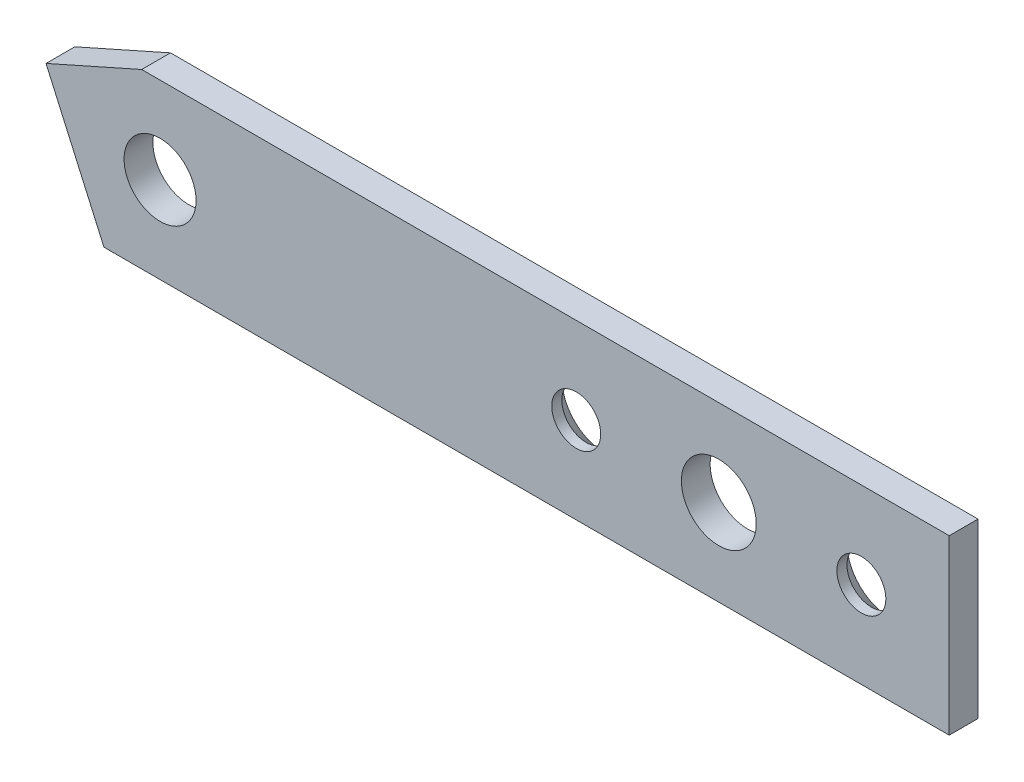
ISO-10303-21;
HEADER;
FILE_DESCRIPTION(('STEP AP214'),'2;1');
FILE_NAME('part.step','',(''),(''),'','','');
FILE_SCHEMA(('AUTOMOTIVE_DESIGN { 1 0 10303 214 1 1 1 1 }'));
ENDSEC;
DATA;
#1=APPLICATION_CONTEXT('core data for automotive mechanical design processes');
#2=APPLICATION_PROTOCOL_DEFINITION('international standard','automotive_design',2000,#1);
#3=PRODUCT_CONTEXT('',#1,'mechanical');
#4=PRODUCT('Part','Part','',(#3));
#5=PRODUCT_RELATED_PRODUCT_CATEGORY('part','',(#4));
#6=PRODUCT_DEFINITION_FORMATION('','',#4);
#7=PRODUCT_DEFINITION_CONTEXT('part definition',#1,'design');
#8=PRODUCT_DEFINITION('design','',#6,#7);
#9=PRODUCT_DEFINITION_SHAPE('','',#8);
#10=(LENGTH_UNIT() NAMED_UNIT(*) SI_UNIT(.MILLI.,.METRE.));
#11=(NAMED_UNIT(*) PLANE_ANGLE_UNIT() SI_UNIT($,.RADIAN.));
#12=(NAMED_UNIT(*) SI_UNIT($,.STERADIAN.) SOLID_ANGLE_UNIT());
#13=UNCERTAINTY_MEASURE_WITH_UNIT(LENGTH_MEASURE(1.E-05),#10,'distance_accuracy_value','');
#14=(GEOMETRIC_REPRESENTATION_CONTEXT(3) GLOBAL_UNCERTAINTY_ASSIGNED_CONTEXT((#13)) GLOBAL_UNIT_ASSIGNED_CONTEXT((#10,
#11,#12)) REPRESENTATION_CONTEXT('',''));
#15=CARTESIAN_POINT('',(0.,0.,0.));
#16=DIRECTION('',(0.,0.,1.));
#17=DIRECTION('',(1.,0.,0.));
#18=AXIS2_PLACEMENT_3D('',#15,#16,#17);
#19=CARTESIAN_POINT('',(274.,30.,-10.));
#20=DIRECTION('',(1.,0.,0.));
#21=DIRECTION('',(0.,0.,-1.));
#22=AXIS2_PLACEMENT_3D('',#19,#20,#21);
#23=PLANE('',#22);
#24=DIRECTION('',(0.,1.,0.));
#25=VECTOR('',#24,1.);
#26=CARTESIAN_POINT('',(274.,30.,0.));
#27=LINE('',#26,#25);
#28=CARTESIAN_POINT('',(274.,-30.,0.));
#29=VERTEX_POINT('',#28);
#30=CARTESIAN_POINT('',(274.,30.,0.));
#31=VERTEX_POINT('',#30);
#32=EDGE_CURVE('E135',#29,#31,#27,.T.);
#33=ORIENTED_EDGE('',*,*,#32,.F.);
#34=DIRECTION('',(0.,0.,1.));
#35=VECTOR('',#34,1.);
#36=CARTESIAN_POINT('',(274.,-30.,-10.));
#37=LINE('',#36,#35);
#38=CARTESIAN_POINT('',(274.,-30.,-10.));
#39=VERTEX_POINT('',#38);
#40=EDGE_CURVE('E66',#39,#29,#37,.T.);
#41=ORIENTED_EDGE('',*,*,#40,.F.);
#42=DIRECTION('',(0.,1.,0.));
#43=VECTOR('',#42,1.);
#44=CARTESIAN_POINT('',(274.,30.,-10.));
#45=LINE('',#44,#43);
#46=CARTESIAN_POINT('',(274.,30.,-10.));
#47=VERTEX_POINT('',#46);
#48=EDGE_CURVE('E129',#39,#47,#45,.T.);
#49=ORIENTED_EDGE('',*,*,#48,.T.);
#50=DIRECTION('',(0.,0.,1.));
#51=VECTOR('',#50,1.);
#52=CARTESIAN_POINT('',(274.,30.,-10.));
#53=LINE('',#52,#51);
#54=EDGE_CURVE('E98',#47,#31,#53,.T.);
#55=ORIENTED_EDGE('',*,*,#54,.T.);
#56=EDGE_LOOP('',(#33,#41,#49,#55));
#57=FACE_BOUND('',#56,.T.);
#58=ADVANCED_FACE('F47',(#57),#23,.T.);
#59=CARTESIAN_POINT('',(-19.4822277959254,-30.,-10.));
#60=DIRECTION('',(0.,-1.,0.));
#61=DIRECTION('',(0.,0.,-1.));
#62=AXIS2_PLACEMENT_3D('',#59,#60,#61);
#63=PLANE('',#62);
#64=DIRECTION('',(1.,0.,0.));
#65=VECTOR('',#64,1.);
#66=CARTESIAN_POINT('',(-19.4822277959254,-30.,0.));
#67=LINE('',#66,#65);
#68=CARTESIAN_POINT('',(-19.4822277959254,-30.,0.));
#69=VERTEX_POINT('',#68);
#70=EDGE_CURVE('E149',#69,#29,#67,.T.);
#71=ORIENTED_EDGE('',*,*,#70,.F.);
#72=DIRECTION('',(0.,0.,1.));
#73=VECTOR('',#72,1.);
#74=CARTESIAN_POINT('',(-19.4822277959254,-30.,-10.));
#75=LINE('',#74,#73);
#76=CARTESIAN_POINT('',(-19.4822277959254,-30.,-10.));
#77=VERTEX_POINT('',#76);
#78=EDGE_CURVE('E86',#77,#69,#75,.T.);
#79=ORIENTED_EDGE('',*,*,#78,.F.);
#80=DIRECTION('',(1.,0.,0.));
#81=VECTOR('',#80,1.);
#82=CARTESIAN_POINT('',(-19.4822277959254,-30.,-10.));
#83=LINE('',#82,#81);
#84=EDGE_CURVE('E120',#77,#39,#83,.T.);
#85=ORIENTED_EDGE('',*,*,#84,.T.);
#86=ORIENTED_EDGE('',*,*,#40,.T.);
#87=EDGE_LOOP('',(#71,#79,#85,#86));
#88=FACE_BOUND('',#87,.T.);
#89=ADVANCED_FACE('F205',(#88),#63,.T.);
#90=CARTESIAN_POINT('',(-19.4822277959254,-30.,-10.));
#91=DIRECTION('',(-0.913545457642604,-0.406736643075794,0.));
#92=DIRECTION('',(0.406736643075794,-0.913545457642604,0.));
#93=AXIS2_PLACEMENT_3D('',#90,#91,#92);
#94=PLANE('',#93);
#95=DIRECTION('',(0.406736643075795,-0.913545457642603,0.));
#96=VECTOR('',#95,1.);
#97=CARTESIAN_POINT('',(-19.4822277959254,-30.,0.));
#98=LINE('',#97,#96);
#99=CARTESIAN_POINT('',(-39.6084630215519,15.2042644370043,0.));
#100=VERTEX_POINT('',#99);
#101=EDGE_CURVE('E108',#100,#69,#98,.T.);
#102=ORIENTED_EDGE('',*,*,#101,.F.);
#103=DIRECTION('',(0.,0.,1.));
#104=VECTOR('',#103,1.);
#105=CARTESIAN_POINT('',(-39.6084630215519,15.2042644370043,-10.));
#106=LINE('',#105,#104);
#107=CARTESIAN_POINT('',(-39.6084630215519,15.2042644370043,-10.));
#108=VERTEX_POINT('',#107);
#109=EDGE_CURVE('E103',#108,#100,#106,.T.);
#110=ORIENTED_EDGE('',*,*,#109,.F.);
#111=DIRECTION('',(0.406736643075795,-0.913545457642603,0.));
#112=VECTOR('',#111,1.);
#113=CARTESIAN_POINT('',(-19.4822277959254,-30.,-10.));
#114=LINE('',#113,#112);
#115=EDGE_CURVE('E106',#108,#77,#114,.T.);
#116=ORIENTED_EDGE('',*,*,#115,.T.);
#117=ORIENTED_EDGE('',*,*,#78,.T.);
#118=EDGE_LOOP('',(#102,#110,#116,#117));
#119=FACE_BOUND('',#118,.T.);
#120=ADVANCED_FACE('F105',(#119),#94,.T.);
#121=CARTESIAN_POINT('',(-6.37669685010055,30.,-10.));
#122=DIRECTION('',(-0.406736643075795,0.913545457642603,0.));
#123=DIRECTION('',(-0.913545457642603,-0.406736643075795,0.));
#124=AXIS2_PLACEMENT_3D('',#121,#122,#123);
#125=PLANE('',#124);
#126=DIRECTION('',(-0.913545457642603,-0.406736643075795,0.));
#127=VECTOR('',#126,1.);
#128=CARTESIAN_POINT('',(-6.37669685010055,30.,0.));
#129=LINE('',#128,#127);
#130=CARTESIAN_POINT('',(-6.37669685010055,30.,0.));
#131=VERTEX_POINT('',#130);
#132=EDGE_CURVE('E144',#131,#100,#129,.T.);
#133=ORIENTED_EDGE('',*,*,#132,.F.);
#134=DIRECTION('',(0.,0.,1.));
#135=VECTOR('',#134,1.);
#136=CARTESIAN_POINT('',(-6.37669685010055,30.,-10.));
#137=LINE('',#136,#135);
#138=CARTESIAN_POINT('',(-6.37669685010055,30.,-10.));
#139=VERTEX_POINT('',#138);
#140=EDGE_CURVE('E114',#139,#131,#137,.T.);
#141=ORIENTED_EDGE('',*,*,#140,.F.);
#142=DIRECTION('',(-0.913545457642603,-0.406736643075795,0.));
#143=VECTOR('',#142,1.);
#144=CARTESIAN_POINT('',(-6.37669685010055,30.,-10.));
#145=LINE('',#144,#143);
#146=EDGE_CURVE('E119',#139,#108,#145,.T.);
#147=ORIENTED_EDGE('',*,*,#146,.T.);
#148=ORIENTED_EDGE('',*,*,#109,.T.);
#149=EDGE_LOOP('',(#133,#141,#147,#148));
#150=FACE_BOUND('',#149,.T.);
#151=ADVANCED_FACE('F123',(#150),#125,.T.);
#152=CARTESIAN_POINT('',(-6.37669685010055,30.,-10.));
#153=DIRECTION('',(0.,1.,0.));
#154=DIRECTION('',(-1.,0.,0.));
#155=AXIS2_PLACEMENT_3D('',#152,#153,#154);
#156=PLANE('',#155);
#157=DIRECTION('',(-1.,0.,0.));
#158=VECTOR('',#157,1.);
#159=CARTESIAN_POINT('',(-6.37669685010055,30.,0.));
#160=LINE('',#159,#158);
#161=EDGE_CURVE('E139',#31,#131,#160,.T.);
#162=ORIENTED_EDGE('',*,*,#161,.F.);
#163=ORIENTED_EDGE('',*,*,#54,.F.);
#164=DIRECTION('',(-1.,0.,0.));
#165=VECTOR('',#164,1.);
#166=CARTESIAN_POINT('',(-6.37669685010055,30.,-10.));
#167=LINE('',#166,#165);
#168=EDGE_CURVE('E125',#47,#139,#167,.T.);
#169=ORIENTED_EDGE('',*,*,#168,.T.);
#170=ORIENTED_EDGE('',*,*,#140,.T.);
#171=EDGE_LOOP('',(#162,#163,#169,#170));
#172=FACE_BOUND('',#171,.T.);
#173=ADVANCED_FACE('F184',(#172),#156,.T.);
#174=CARTESIAN_POINT('',(0.,0.,-10.));
#175=DIRECTION('',(0.,0.,1.));
#176=DIRECTION('',(1.,0.,0.));
#177=AXIS2_PLACEMENT_3D('',#174,#175,#176);
#178=PLANE('',#177);
#179=CARTESIAN_POINT('',(144.5,0.,-10.));
#180=DIRECTION('',(0.,0.,1.));
#181=DIRECTION('',(1.,0.,0.));
#182=AXIS2_PLACEMENT_3D('',#179,#180,#181);
#183=CIRCLE('',#182,14.9999999999999);
#184=CARTESIAN_POINT('',(159.5,0.,-10.));
#185=VERTEX_POINT('',#184);
#186=EDGE_CURVE('E165',#185,#185,#183,.T.);
#187=ORIENTED_EDGE('',*,*,#186,.T.);
#188=EDGE_LOOP('',(#187));
#189=FACE_BOUND('',#188,.T.);
#190=CARTESIAN_POINT('',(243.5,0.,-10.));
#191=DIRECTION('',(0.,0.,1.));
#192=DIRECTION('',(1.,0.,0.));
#193=AXIS2_PLACEMENT_3D('',#190,#191,#192);
#194=CIRCLE('',#193,14.9999999999999);
#195=CARTESIAN_POINT('',(258.5,0.,-10.));
#196=VERTEX_POINT('',#195);
#197=EDGE_CURVE('E155',#196,#196,#194,.T.);
#198=ORIENTED_EDGE('',*,*,#197,.T.);
#199=EDGE_LOOP('',(#198));
#200=FACE_BOUND('',#199,.T.);
#201=CARTESIAN_POINT('',(194.,0.,-10.));
#202=DIRECTION('',(0.,0.,1.));
#203=DIRECTION('',(1.,0.,0.));
#204=AXIS2_PLACEMENT_3D('',#201,#202,#203);
#205=CIRCLE('',#204,13.);
#206=CARTESIAN_POINT('',(207.,0.,-10.));
#207=VERTEX_POINT('',#206);
#208=EDGE_CURVE('E191',#207,#207,#205,.T.);
#209=ORIENTED_EDGE('',*,*,#208,.T.);
#210=EDGE_LOOP('',(#209));
#211=FACE_BOUND('',#210,.T.);
#212=CARTESIAN_POINT('',(0.,0.,-10.));
#213=DIRECTION('',(0.,0.,1.));
#214=DIRECTION('',(1.,0.,0.));
#215=AXIS2_PLACEMENT_3D('',#212,#213,#214);
#216=CIRCLE('',#215,12.5);
#217=CARTESIAN_POINT('',(12.5,0.,-10.));
#218=VERTEX_POINT('',#217);
#219=EDGE_CURVE('E140',#218,#218,#216,.T.);
#220=ORIENTED_EDGE('',*,*,#219,.T.);
#221=EDGE_LOOP('',(#220));
#222=FACE_BOUND('',#221,.T.);
#223=ORIENTED_EDGE('',*,*,#48,.F.);
#224=ORIENTED_EDGE('',*,*,#84,.F.);
#225=ORIENTED_EDGE('',*,*,#115,.F.);
#226=ORIENTED_EDGE('',*,*,#146,.F.);
#227=ORIENTED_EDGE('',*,*,#168,.F.);
#228=EDGE_LOOP('',(#223,#224,#225,#226,#227));
#229=FACE_BOUND('',#228,.T.);
#230=ADVANCED_FACE('F118',(#189,#200,#211,#222,#229),#178,.F.);
#231=CARTESIAN_POINT('',(0.,0.,0.));
#232=DIRECTION('',(0.,0.,1.));
#233=DIRECTION('',(1.,0.,0.));
#234=AXIS2_PLACEMENT_3D('',#231,#232,#233);
#235=PLANE('',#234);
#236=CARTESIAN_POINT('',(144.5,0.,0.));
#237=DIRECTION('',(0.,0.,1.));
#238=DIRECTION('',(1.,0.,0.));
#239=AXIS2_PLACEMENT_3D('',#236,#237,#238);
#240=CIRCLE('',#239,8.50000000000001);
#241=CARTESIAN_POINT('',(153.,0.,0.));
#242=VERTEX_POINT('',#241);
#243=EDGE_CURVE('E367',#242,#242,#240,.T.);
#244=ORIENTED_EDGE('',*,*,#243,.F.);
#245=EDGE_LOOP('',(#244));
#246=FACE_BOUND('',#245,.T.);
#247=CARTESIAN_POINT('',(243.5,0.,0.));
#248=DIRECTION('',(0.,0.,1.));
#249=DIRECTION('',(1.,0.,0.));
#250=AXIS2_PLACEMENT_3D('',#247,#248,#249);
#251=CIRCLE('',#250,8.50000000000001);
#252=CARTESIAN_POINT('',(252.,0.,0.));
#253=VERTEX_POINT('',#252);
#254=EDGE_CURVE('E363',#253,#253,#251,.T.);
#255=ORIENTED_EDGE('',*,*,#254,.F.);
#256=EDGE_LOOP('',(#255));
#257=FACE_BOUND('',#256,.T.);
#258=CARTESIAN_POINT('',(194.,0.,0.));
#259=DIRECTION('',(0.,0.,1.));
#260=DIRECTION('',(1.,0.,0.));
#261=AXIS2_PLACEMENT_3D('',#258,#259,#260);
#262=CIRCLE('',#261,13.);
#263=CARTESIAN_POINT('',(207.,0.,0.));
#264=VERTEX_POINT('',#263);
#265=EDGE_CURVE('E366',#264,#264,#262,.T.);
#266=ORIENTED_EDGE('',*,*,#265,.F.);
#267=EDGE_LOOP('',(#266));
#268=FACE_BOUND('',#267,.T.);
#269=CARTESIAN_POINT('',(0.,0.,0.));
#270=DIRECTION('',(0.,0.,1.));
#271=DIRECTION('',(1.,0.,0.));
#272=AXIS2_PLACEMENT_3D('',#269,#270,#271);
#273=CIRCLE('',#272,12.5);
#274=CARTESIAN_POINT('',(12.5,0.,0.));
#275=VERTEX_POINT('',#274);
#276=EDGE_CURVE('E196',#275,#275,#273,.T.);
#277=ORIENTED_EDGE('',*,*,#276,.F.);
#278=EDGE_LOOP('',(#277));
#279=FACE_BOUND('',#278,.T.);
#280=ORIENTED_EDGE('',*,*,#32,.T.);
#281=ORIENTED_EDGE('',*,*,#161,.T.);
#282=ORIENTED_EDGE('',*,*,#132,.T.);
#283=ORIENTED_EDGE('',*,*,#101,.T.);
#284=ORIENTED_EDGE('',*,*,#70,.T.);
#285=EDGE_LOOP('',(#280,#281,#282,#283,#284));
#286=FACE_BOUND('',#285,.T.);
#287=ADVANCED_FACE('F183',(#246,#257,#268,#279,#286),#235,.T.);
#288=CARTESIAN_POINT('',(0.,0.,0.));
#289=DIRECTION('',(0.,0.,1.));
#290=DIRECTION('',(1.,0.,0.));
#291=AXIS2_PLACEMENT_3D('',#288,#289,#290);
#292=CYLINDRICAL_SURFACE('',#291,12.5);
#293=ORIENTED_EDGE('',*,*,#219,.F.);
#294=EDGE_LOOP('',(#293));
#295=FACE_BOUND('',#294,.T.);
#296=ORIENTED_EDGE('',*,*,#276,.T.);
#297=EDGE_LOOP('',(#296));
#298=FACE_BOUND('',#297,.T.);
#299=ADVANCED_FACE('F230',(#295,#298),#292,.F.);
#300=CARTESIAN_POINT('',(194.,0.,0.));
#301=DIRECTION('',(0.,0.,1.));
#302=DIRECTION('',(1.,0.,0.));
#303=AXIS2_PLACEMENT_3D('',#300,#301,#302);
#304=CYLINDRICAL_SURFACE('',#303,13.);
#305=ORIENTED_EDGE('',*,*,#208,.F.);
#306=EDGE_LOOP('',(#305));
#307=FACE_BOUND('',#306,.T.);
#308=ORIENTED_EDGE('',*,*,#265,.T.);
#309=EDGE_LOOP('',(#308));
#310=FACE_BOUND('',#309,.T.);
#311=ADVANCED_FACE('F235',(#307,#310),#304,.F.);
#312=CARTESIAN_POINT('',(243.5,0.,0.));
#313=DIRECTION('',(0.,0.,1.));
#314=DIRECTION('',(1.,0.,0.));
#315=AXIS2_PLACEMENT_3D('',#312,#313,#314);
#316=CYLINDRICAL_SURFACE('',#315,8.50000000000001);
#317=CARTESIAN_POINT('',(243.5,0.,-3.50000000000004));
#318=DIRECTION('',(0.,0.,1.));
#319=DIRECTION('',(1.,0.,0.));
#320=AXIS2_PLACEMENT_3D('',#317,#318,#319);
#321=CIRCLE('',#320,8.50000000000001);
#322=CARTESIAN_POINT('',(252.,0.,-3.50000000000004));
#323=VERTEX_POINT('',#322);
#324=EDGE_CURVE('E11',#323,#323,#321,.F.);
#325=ORIENTED_EDGE('',*,*,#324,.T.);
#326=EDGE_LOOP('',(#325));
#327=FACE_BOUND('',#326,.T.);
#328=ORIENTED_EDGE('',*,*,#254,.T.);
#329=EDGE_LOOP('',(#328));
#330=FACE_BOUND('',#329,.T.);
#331=ADVANCED_FACE('F238',(#327,#330),#316,.F.);
#332=CARTESIAN_POINT('',(144.5,0.,0.));
#333=DIRECTION('',(0.,0.,1.));
#334=DIRECTION('',(1.,0.,0.));
#335=AXIS2_PLACEMENT_3D('',#332,#333,#334);
#336=CYLINDRICAL_SURFACE('',#335,8.50000000000001);
#337=CARTESIAN_POINT('',(144.5,0.,-3.50000000000004));
#338=DIRECTION('',(0.,0.,1.));
#339=DIRECTION('',(1.,0.,0.));
#340=AXIS2_PLACEMENT_3D('',#337,#338,#339);
#341=CIRCLE('',#340,8.50000000000001);
#342=CARTESIAN_POINT('',(153.,0.,-3.50000000000004));
#343=VERTEX_POINT('',#342);
#344=EDGE_CURVE('E58',#343,#343,#341,.F.);
#345=ORIENTED_EDGE('',*,*,#344,.T.);
#346=EDGE_LOOP('',(#345));
#347=FACE_BOUND('',#346,.T.);
#348=ORIENTED_EDGE('',*,*,#243,.T.);
#349=EDGE_LOOP('',(#348));
#350=FACE_BOUND('',#349,.T.);
#351=ADVANCED_FACE('F173',(#347,#350),#336,.F.);
#352=CARTESIAN_POINT('',(144.5,0.,-10.));
#353=DIRECTION('',(0.,0.,-1.));
#354=DIRECTION('',(-1.,0.,0.));
#355=AXIS2_PLACEMENT_3D('',#352,#353,#354);
#356=CONICAL_SURFACE('',#355,14.9999999999999,0.785398163397445);
#357=ORIENTED_EDGE('',*,*,#344,.F.);
#358=EDGE_LOOP('',(#357));
#359=FACE_BOUND('',#358,.T.);
#360=ORIENTED_EDGE('',*,*,#186,.F.);
#361=EDGE_LOOP('',(#360));
#362=FACE_BOUND('',#361,.T.);
#363=ADVANCED_FACE('F176',(#359,#362),#356,.F.);
#364=CARTESIAN_POINT('',(243.5,0.,-10.));
#365=DIRECTION('',(0.,0.,-1.));
#366=DIRECTION('',(-1.,0.,0.));
#367=AXIS2_PLACEMENT_3D('',#364,#365,#366);
#368=CONICAL_SURFACE('',#367,14.9999999999999,0.785398163397445);
#369=ORIENTED_EDGE('',*,*,#324,.F.);
#370=EDGE_LOOP('',(#369));
#371=FACE_BOUND('',#370,.T.);
#372=ORIENTED_EDGE('',*,*,#197,.F.);
#373=EDGE_LOOP('',(#372));
#374=FACE_BOUND('',#373,.T.);
#375=ADVANCED_FACE('F50',(#371,#374),#368,.F.);
#376=CLOSED_SHELL('',(#58,#89,#120,#151,#173,#230,#287,#299,#311,#331,#351,#363,#375));
#377=MANIFOLD_SOLID_BREP('B2',#376);
#378=ADVANCED_BREP_SHAPE_REPRESENTATION('',(#18,#377),#14);
#379=SHAPE_DEFINITION_REPRESENTATION(#9,#378);
ENDSEC;
END-ISO-10303-21;
